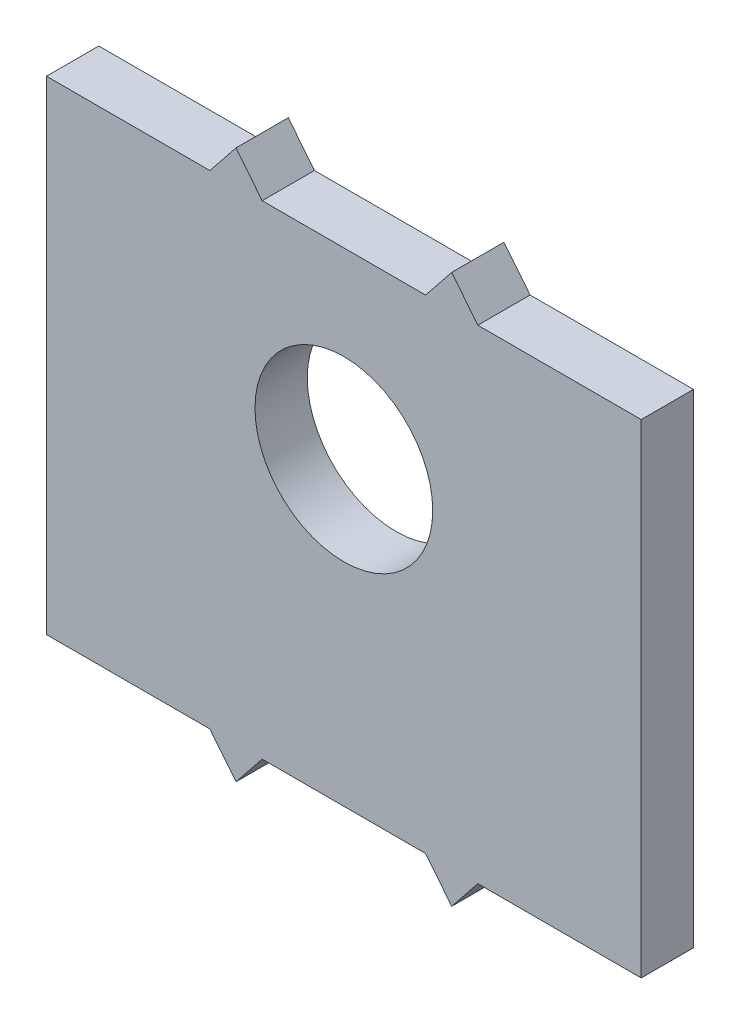
ISO-10303-21;
HEADER;
FILE_DESCRIPTION(('STEP AP214'),'2;1');
FILE_NAME('part.step','',(''),(''),'','','');
FILE_SCHEMA(('AUTOMOTIVE_DESIGN { 1 0 10303 214 1 1 1 1 }'));
ENDSEC;
DATA;
#1=APPLICATION_CONTEXT('core data for automotive mechanical design processes');
#2=APPLICATION_PROTOCOL_DEFINITION('international standard','automotive_design',2000,#1);
#3=PRODUCT_CONTEXT('',#1,'mechanical');
#4=PRODUCT('Part','Part','',(#3));
#5=PRODUCT_RELATED_PRODUCT_CATEGORY('part','',(#4));
#6=PRODUCT_DEFINITION_FORMATION('','',#4);
#7=PRODUCT_DEFINITION_CONTEXT('part definition',#1,'design');
#8=PRODUCT_DEFINITION('design','',#6,#7);
#9=PRODUCT_DEFINITION_SHAPE('','',#8);
#10=(LENGTH_UNIT() NAMED_UNIT(*) SI_UNIT(.MILLI.,.METRE.));
#11=(NAMED_UNIT(*) PLANE_ANGLE_UNIT() SI_UNIT($,.RADIAN.));
#12=(NAMED_UNIT(*) SI_UNIT($,.STERADIAN.) SOLID_ANGLE_UNIT());
#13=UNCERTAINTY_MEASURE_WITH_UNIT(LENGTH_MEASURE(1.E-05),#10,'distance_accuracy_value','');
#14=(GEOMETRIC_REPRESENTATION_CONTEXT(3) GLOBAL_UNCERTAINTY_ASSIGNED_CONTEXT((#13)) GLOBAL_UNIT_ASSIGNED_CONTEXT((#10,
#11,#12)) REPRESENTATION_CONTEXT('',''));
#15=CARTESIAN_POINT('',(0.,0.,0.));
#16=DIRECTION('',(0.,0.,1.));
#17=DIRECTION('',(1.,0.,0.));
#18=AXIS2_PLACEMENT_3D('',#15,#16,#17);
#19=CARTESIAN_POINT('',(0.,0.,4.));
#20=DIRECTION('',(0.,1.,0.));
#21=DIRECTION('',(0.,0.,1.));
#22=AXIS2_PLACEMENT_3D('',#19,#20,#21);
#23=PLANE('',#22);
#24=DIRECTION('',(1.,0.,0.));
#25=VECTOR('',#24,1.);
#26=CARTESIAN_POINT('',(0.,0.,0.));
#27=LINE('',#26,#25);
#28=CARTESIAN_POINT('',(0.,0.,0.));
#29=VERTEX_POINT('',#28);
#30=CARTESIAN_POINT('',(12.5,0.,0.));
#31=VERTEX_POINT('',#30);
#32=EDGE_CURVE('E215',#29,#31,#27,.T.);
#33=ORIENTED_EDGE('',*,*,#32,.T.);
#34=DIRECTION('',(0.,0.,-1.));
#35=VECTOR('',#34,1.);
#36=CARTESIAN_POINT('',(12.5,0.,4.));
#37=LINE('',#36,#35);
#38=CARTESIAN_POINT('',(12.5,0.,4.));
#39=VERTEX_POINT('',#38);
#40=EDGE_CURVE('E11',#39,#31,#37,.T.);
#41=ORIENTED_EDGE('',*,*,#40,.F.);
#42=DIRECTION('',(1.,0.,0.));
#43=VECTOR('',#42,1.);
#44=CARTESIAN_POINT('',(0.,0.,4.));
#45=LINE('',#44,#43);
#46=CARTESIAN_POINT('',(0.,0.,4.));
#47=VERTEX_POINT('',#46);
#48=EDGE_CURVE('E201',#47,#39,#45,.T.);
#49=ORIENTED_EDGE('',*,*,#48,.F.);
#50=DIRECTION('',(0.,0.,-1.));
#51=VECTOR('',#50,1.);
#52=CARTESIAN_POINT('',(0.,0.,4.));
#53=LINE('',#52,#51);
#54=EDGE_CURVE('E57',#47,#29,#53,.T.);
#55=ORIENTED_EDGE('',*,*,#54,.T.);
#56=EDGE_LOOP('',(#33,#41,#49,#55));
#57=FACE_BOUND('',#56,.T.);
#58=ADVANCED_FACE('F40',(#57),#23,.F.);
#59=CARTESIAN_POINT('',(7.6219512195122,6.09756097560976,4.));
#60=DIRECTION('',(0.78086880944303,0.624695047554424,0.));
#61=DIRECTION('',(-0.624695047554424,0.78086880944303,0.));
#62=AXIS2_PLACEMENT_3D('',#59,#60,#61);
#63=PLANE('',#62);
#64=DIRECTION('',(0.624695047554424,-0.78086880944303,0.));
#65=VECTOR('',#64,1.);
#66=CARTESIAN_POINT('',(7.6219512195122,6.09756097560976,0.));
#67=LINE('',#66,#65);
#68=CARTESIAN_POINT('',(14.5,-2.5,0.));
#69=VERTEX_POINT('',#68);
#70=EDGE_CURVE('E326',#31,#69,#67,.T.);
#71=ORIENTED_EDGE('',*,*,#70,.T.);
#72=DIRECTION('',(0.,0.,-1.));
#73=VECTOR('',#72,1.);
#74=CARTESIAN_POINT('',(14.5,-2.5,4.));
#75=LINE('',#74,#73);
#76=CARTESIAN_POINT('',(14.5,-2.5,4.));
#77=VERTEX_POINT('',#76);
#78=EDGE_CURVE('E49',#77,#69,#75,.T.);
#79=ORIENTED_EDGE('',*,*,#78,.F.);
#80=DIRECTION('',(0.624695047554424,-0.78086880944303,0.));
#81=VECTOR('',#80,1.);
#82=CARTESIAN_POINT('',(7.6219512195122,6.09756097560976,4.));
#83=LINE('',#82,#81);
#84=EDGE_CURVE('E119',#39,#77,#83,.T.);
#85=ORIENTED_EDGE('',*,*,#84,.F.);
#86=ORIENTED_EDGE('',*,*,#40,.T.);
#87=EDGE_LOOP('',(#71,#79,#85,#86));
#88=FACE_BOUND('',#87,.T.);
#89=ADVANCED_FACE('F42',(#88),#63,.F.);
#90=CARTESIAN_POINT('',(10.0609756097561,-8.04878048780488,4.));
#91=DIRECTION('',(-0.780868809443031,0.624695047554424,0.));
#92=DIRECTION('',(-0.624695047554424,-0.780868809443031,0.));
#93=AXIS2_PLACEMENT_3D('',#90,#91,#92);
#94=PLANE('',#93);
#95=DIRECTION('',(0.624695047554424,0.780868809443031,0.));
#96=VECTOR('',#95,1.);
#97=CARTESIAN_POINT('',(10.0609756097561,-8.04878048780488,0.));
#98=LINE('',#97,#96);
#99=CARTESIAN_POINT('',(16.5,0.,0.));
#100=VERTEX_POINT('',#99);
#101=EDGE_CURVE('E324',#69,#100,#98,.T.);
#102=ORIENTED_EDGE('',*,*,#101,.T.);
#103=DIRECTION('',(0.,0.,-1.));
#104=VECTOR('',#103,1.);
#105=CARTESIAN_POINT('',(16.5,0.,4.));
#106=LINE('',#105,#104);
#107=CARTESIAN_POINT('',(16.5,0.,4.));
#108=VERTEX_POINT('',#107);
#109=EDGE_CURVE('E317',#108,#100,#106,.T.);
#110=ORIENTED_EDGE('',*,*,#109,.F.);
#111=DIRECTION('',(0.624695047554424,0.780868809443031,0.));
#112=VECTOR('',#111,1.);
#113=CARTESIAN_POINT('',(10.0609756097561,-8.04878048780488,4.));
#114=LINE('',#113,#112);
#115=EDGE_CURVE('E208',#77,#108,#114,.T.);
#116=ORIENTED_EDGE('',*,*,#115,.F.);
#117=ORIENTED_EDGE('',*,*,#78,.T.);
#118=EDGE_LOOP('',(#102,#110,#116,#117));
#119=FACE_BOUND('',#118,.T.);
#120=ADVANCED_FACE('F242',(#119),#94,.F.);
#121=CARTESIAN_POINT('',(29.,0.,0.));
#122=VERTEX_POINT('',#121);
#123=EDGE_CURVE('E273',#100,#122,#27,.T.);
#124=ORIENTED_EDGE('',*,*,#123,.T.);
#125=DIRECTION('',(0.,0.,-1.));
#126=VECTOR('',#125,1.);
#127=CARTESIAN_POINT('',(29.,0.,4.));
#128=LINE('',#127,#126);
#129=CARTESIAN_POINT('',(29.,0.,4.));
#130=VERTEX_POINT('',#129);
#131=EDGE_CURVE('E315',#130,#122,#128,.T.);
#132=ORIENTED_EDGE('',*,*,#131,.F.);
#133=EDGE_CURVE('E200',#108,#130,#45,.T.);
#134=ORIENTED_EDGE('',*,*,#133,.F.);
#135=ORIENTED_EDGE('',*,*,#109,.T.);
#136=EDGE_LOOP('',(#124,#132,#134,#135));
#137=FACE_BOUND('',#136,.T.);
#138=ADVANCED_FACE('F237',(#137),#23,.F.);
#139=CARTESIAN_POINT('',(17.6829268292683,14.1463414634146,4.));
#140=DIRECTION('',(-0.78086880944303,-0.624695047554424,0.));
#141=DIRECTION('',(0.624695047554424,-0.78086880944303,0.));
#142=AXIS2_PLACEMENT_3D('',#139,#140,#141);
#143=PLANE('',#142);
#144=DIRECTION('',(-0.624695047554424,0.78086880944303,0.));
#145=VECTOR('',#144,1.);
#146=CARTESIAN_POINT('',(17.6829268292683,14.1463414634146,0.));
#147=LINE('',#146,#145);
#148=CARTESIAN_POINT('',(31.,-2.5,0.));
#149=VERTEX_POINT('',#148);
#150=EDGE_CURVE('E330',#149,#122,#147,.T.);
#151=ORIENTED_EDGE('',*,*,#150,.F.);
#152=DIRECTION('',(0.,0.,-1.));
#153=VECTOR('',#152,1.);
#154=CARTESIAN_POINT('',(31.,-2.5,4.));
#155=LINE('',#154,#153);
#156=CARTESIAN_POINT('',(31.,-2.5,4.));
#157=VERTEX_POINT('',#156);
#158=EDGE_CURVE('E313',#157,#149,#155,.T.);
#159=ORIENTED_EDGE('',*,*,#158,.F.);
#160=DIRECTION('',(-0.624695047554424,0.78086880944303,0.));
#161=VECTOR('',#160,1.);
#162=CARTESIAN_POINT('',(17.6829268292683,14.1463414634146,4.));
#163=LINE('',#162,#161);
#164=EDGE_CURVE('E205',#157,#130,#163,.T.);
#165=ORIENTED_EDGE('',*,*,#164,.T.);
#166=ORIENTED_EDGE('',*,*,#131,.T.);
#167=EDGE_LOOP('',(#151,#159,#165,#166));
#168=FACE_BOUND('',#167,.T.);
#169=ADVANCED_FACE('F246',(#168),#143,.T.);
#170=CARTESIAN_POINT('',(20.1219512195122,-16.0975609756098,4.));
#171=DIRECTION('',(0.78086880944303,-0.624695047554424,0.));
#172=DIRECTION('',(0.624695047554424,0.78086880944303,0.));
#173=AXIS2_PLACEMENT_3D('',#170,#171,#172);
#174=PLANE('',#173);
#175=DIRECTION('',(-0.624695047554424,-0.78086880944303,0.));
#176=VECTOR('',#175,1.);
#177=CARTESIAN_POINT('',(20.1219512195122,-16.0975609756098,0.));
#178=LINE('',#177,#176);
#179=CARTESIAN_POINT('',(33.,0.,0.));
#180=VERTEX_POINT('',#179);
#181=EDGE_CURVE('E271',#180,#149,#178,.T.);
#182=ORIENTED_EDGE('',*,*,#181,.F.);
#183=DIRECTION('',(0.,0.,-1.));
#184=VECTOR('',#183,1.);
#185=CARTESIAN_POINT('',(33.,0.,4.));
#186=LINE('',#185,#184);
#187=CARTESIAN_POINT('',(33.,0.,4.));
#188=VERTEX_POINT('',#187);
#189=EDGE_CURVE('E265',#188,#180,#186,.T.);
#190=ORIENTED_EDGE('',*,*,#189,.F.);
#191=DIRECTION('',(-0.624695047554424,-0.78086880944303,0.));
#192=VECTOR('',#191,1.);
#193=CARTESIAN_POINT('',(20.1219512195122,-16.0975609756098,4.));
#194=LINE('',#193,#192);
#195=EDGE_CURVE('E198',#188,#157,#194,.T.);
#196=ORIENTED_EDGE('',*,*,#195,.T.);
#197=ORIENTED_EDGE('',*,*,#158,.T.);
#198=EDGE_LOOP('',(#182,#190,#196,#197));
#199=FACE_BOUND('',#198,.T.);
#200=ADVANCED_FACE('F250',(#199),#174,.T.);
#201=CARTESIAN_POINT('',(45.5,0.,0.));
#202=VERTEX_POINT('',#201);
#203=EDGE_CURVE('E261',#180,#202,#27,.T.);
#204=ORIENTED_EDGE('',*,*,#203,.T.);
#205=DIRECTION('',(0.,0.,-1.));
#206=VECTOR('',#205,1.);
#207=CARTESIAN_POINT('',(45.5,0.,4.));
#208=LINE('',#207,#206);
#209=CARTESIAN_POINT('',(45.5,0.,4.));
#210=VERTEX_POINT('',#209);
#211=EDGE_CURVE('E264',#210,#202,#208,.T.);
#212=ORIENTED_EDGE('',*,*,#211,.F.);
#213=EDGE_CURVE('E195',#188,#210,#45,.T.);
#214=ORIENTED_EDGE('',*,*,#213,.F.);
#215=ORIENTED_EDGE('',*,*,#189,.T.);
#216=EDGE_LOOP('',(#204,#212,#214,#215));
#217=FACE_BOUND('',#216,.T.);
#218=ADVANCED_FACE('F238',(#217),#23,.F.);
#219=CARTESIAN_POINT('',(45.5,0.,4.));
#220=DIRECTION('',(-1.,0.,0.));
#221=DIRECTION('',(0.,0.,1.));
#222=AXIS2_PLACEMENT_3D('',#219,#220,#221);
#223=PLANE('',#222);
#224=DIRECTION('',(0.,1.,0.));
#225=VECTOR('',#224,1.);
#226=CARTESIAN_POINT('',(45.5,0.,0.));
#227=LINE('',#226,#225);
#228=CARTESIAN_POINT('',(45.5,37.,0.));
#229=VERTEX_POINT('',#228);
#230=EDGE_CURVE('E270',#202,#229,#227,.T.);
#231=ORIENTED_EDGE('',*,*,#230,.T.);
#232=DIRECTION('',(0.,0.,-1.));
#233=VECTOR('',#232,1.);
#234=CARTESIAN_POINT('',(45.5,37.,4.));
#235=LINE('',#234,#233);
#236=CARTESIAN_POINT('',(45.5,37.,4.));
#237=VERTEX_POINT('',#236);
#238=EDGE_CURVE('E276',#237,#229,#235,.T.);
#239=ORIENTED_EDGE('',*,*,#238,.F.);
#240=DIRECTION('',(0.,1.,0.));
#241=VECTOR('',#240,1.);
#242=CARTESIAN_POINT('',(45.5,0.,4.));
#243=LINE('',#242,#241);
#244=EDGE_CURVE('E192',#210,#237,#243,.T.);
#245=ORIENTED_EDGE('',*,*,#244,.F.);
#246=ORIENTED_EDGE('',*,*,#211,.T.);
#247=EDGE_LOOP('',(#231,#239,#245,#246));
#248=FACE_BOUND('',#247,.T.);
#249=ADVANCED_FACE('F249',(#248),#223,.F.);
#250=CARTESIAN_POINT('',(0.,37.,4.));
#251=DIRECTION('',(0.,1.,0.));
#252=DIRECTION('',(-1.,0.,0.));
#253=AXIS2_PLACEMENT_3D('',#250,#251,#252);
#254=PLANE('',#253);
#255=DIRECTION('',(1.,0.,0.));
#256=VECTOR('',#255,1.);
#257=CARTESIAN_POINT('',(0.,37.,0.));
#258=LINE('',#257,#256);
#259=CARTESIAN_POINT('',(33.,37.,0.));
#260=VERTEX_POINT('',#259);
#261=EDGE_CURVE('E280',#260,#229,#258,.T.);
#262=ORIENTED_EDGE('',*,*,#261,.F.);
#263=DIRECTION('',(0.,0.,-1.));
#264=VECTOR('',#263,1.);
#265=CARTESIAN_POINT('',(33.,37.,4.));
#266=LINE('',#265,#264);
#267=CARTESIAN_POINT('',(33.,37.,4.));
#268=VERTEX_POINT('',#267);
#269=EDGE_CURVE('E309',#268,#260,#266,.T.);
#270=ORIENTED_EDGE('',*,*,#269,.F.);
#271=DIRECTION('',(1.,0.,0.));
#272=VECTOR('',#271,1.);
#273=CARTESIAN_POINT('',(0.,37.,4.));
#274=LINE('',#273,#272);
#275=EDGE_CURVE('E184',#268,#237,#274,.T.);
#276=ORIENTED_EDGE('',*,*,#275,.T.);
#277=ORIENTED_EDGE('',*,*,#238,.T.);
#278=EDGE_LOOP('',(#262,#270,#276,#277));
#279=FACE_BOUND('',#278,.T.);
#280=ADVANCED_FACE('F256',(#279),#254,.T.);
#281=CARTESIAN_POINT('',(38.1707317073171,30.5365853658537,4.));
#282=DIRECTION('',(-0.78086880944303,-0.624695047554424,0.));
#283=DIRECTION('',(0.624695047554424,-0.78086880944303,0.));
#284=AXIS2_PLACEMENT_3D('',#281,#282,#283);
#285=PLANE('',#284);
#286=DIRECTION('',(-0.624695047554424,0.78086880944303,0.));
#287=VECTOR('',#286,1.);
#288=CARTESIAN_POINT('',(38.1707317073171,30.5365853658537,0.));
#289=LINE('',#288,#287);
#290=CARTESIAN_POINT('',(31.,39.5,0.));
#291=VERTEX_POINT('',#290);
#292=EDGE_CURVE('E282',#260,#291,#289,.T.);
#293=ORIENTED_EDGE('',*,*,#292,.T.);
#294=DIRECTION('',(0.,0.,-1.));
#295=VECTOR('',#294,1.);
#296=CARTESIAN_POINT('',(31.,39.5,4.));
#297=LINE('',#296,#295);
#298=CARTESIAN_POINT('',(31.,39.5,4.));
#299=VERTEX_POINT('',#298);
#300=EDGE_CURVE('E306',#299,#291,#297,.T.);
#301=ORIENTED_EDGE('',*,*,#300,.F.);
#302=DIRECTION('',(-0.624695047554424,0.78086880944303,0.));
#303=VECTOR('',#302,1.);
#304=CARTESIAN_POINT('',(38.1707317073171,30.5365853658537,4.));
#305=LINE('',#304,#303);
#306=EDGE_CURVE('E191',#268,#299,#305,.T.);
#307=ORIENTED_EDGE('',*,*,#306,.F.);
#308=ORIENTED_EDGE('',*,*,#269,.T.);
#309=EDGE_LOOP('',(#293,#301,#307,#308));
#310=FACE_BOUND('',#309,.T.);
#311=ADVANCED_FACE('F356',(#310),#285,.F.);
#312=CARTESIAN_POINT('',(-0.365853658536584,0.292682926829267,4.));
#313=DIRECTION('',(0.78086880944303,-0.624695047554424,0.));
#314=DIRECTION('',(0.624695047554424,0.78086880944303,0.));
#315=AXIS2_PLACEMENT_3D('',#312,#313,#314);
#316=PLANE('',#315);
#317=DIRECTION('',(-0.624695047554424,-0.78086880944303,0.));
#318=VECTOR('',#317,1.);
#319=CARTESIAN_POINT('',(-0.365853658536584,0.292682926829267,0.));
#320=LINE('',#319,#318);
#321=CARTESIAN_POINT('',(29.,37.,0.));
#322=VERTEX_POINT('',#321);
#323=EDGE_CURVE('E290',#291,#322,#320,.T.);
#324=ORIENTED_EDGE('',*,*,#323,.T.);
#325=DIRECTION('',(0.,0.,-1.));
#326=VECTOR('',#325,1.);
#327=CARTESIAN_POINT('',(29.,37.,4.));
#328=LINE('',#327,#326);
#329=CARTESIAN_POINT('',(29.,37.,4.));
#330=VERTEX_POINT('',#329);
#331=EDGE_CURVE('E304',#330,#322,#328,.T.);
#332=ORIENTED_EDGE('',*,*,#331,.F.);
#333=DIRECTION('',(-0.624695047554424,-0.78086880944303,0.));
#334=VECTOR('',#333,1.);
#335=CARTESIAN_POINT('',(-0.365853658536584,0.292682926829267,4.));
#336=LINE('',#335,#334);
#337=EDGE_CURVE('E189',#299,#330,#336,.T.);
#338=ORIENTED_EDGE('',*,*,#337,.F.);
#339=ORIENTED_EDGE('',*,*,#300,.T.);
#340=EDGE_LOOP('',(#324,#332,#338,#339));
#341=FACE_BOUND('',#340,.T.);
#342=ADVANCED_FACE('F346',(#341),#316,.F.);
#343=CARTESIAN_POINT('',(16.5,37.,0.));
#344=VERTEX_POINT('',#343);
#345=EDGE_CURVE('E285',#344,#322,#258,.T.);
#346=ORIENTED_EDGE('',*,*,#345,.F.);
#347=DIRECTION('',(0.,0.,-1.));
#348=VECTOR('',#347,1.);
#349=CARTESIAN_POINT('',(16.5,37.,4.));
#350=LINE('',#349,#348);
#351=CARTESIAN_POINT('',(16.5,37.,4.));
#352=VERTEX_POINT('',#351);
#353=EDGE_CURVE('E302',#352,#344,#350,.T.);
#354=ORIENTED_EDGE('',*,*,#353,.F.);
#355=EDGE_CURVE('E183',#352,#330,#274,.T.);
#356=ORIENTED_EDGE('',*,*,#355,.T.);
#357=ORIENTED_EDGE('',*,*,#331,.T.);
#358=EDGE_LOOP('',(#346,#354,#356,#357));
#359=FACE_BOUND('',#358,.T.);
#360=ADVANCED_FACE('F351',(#359),#254,.T.);
#361=CARTESIAN_POINT('',(28.109756097561,22.4878048780488,4.));
#362=DIRECTION('',(0.78086880944303,0.624695047554424,0.));
#363=DIRECTION('',(-0.624695047554424,0.78086880944303,0.));
#364=AXIS2_PLACEMENT_3D('',#361,#362,#363);
#365=PLANE('',#364);
#366=DIRECTION('',(0.624695047554424,-0.78086880944303,0.));
#367=VECTOR('',#366,1.);
#368=CARTESIAN_POINT('',(28.109756097561,22.4878048780488,0.));
#369=LINE('',#368,#367);
#370=CARTESIAN_POINT('',(14.5,39.5,0.));
#371=VERTEX_POINT('',#370);
#372=EDGE_CURVE('E293',#371,#344,#369,.T.);
#373=ORIENTED_EDGE('',*,*,#372,.F.);
#374=DIRECTION('',(0.,0.,-1.));
#375=VECTOR('',#374,1.);
#376=CARTESIAN_POINT('',(14.5,39.5,4.));
#377=LINE('',#376,#375);
#378=CARTESIAN_POINT('',(14.5,39.5,4.));
#379=VERTEX_POINT('',#378);
#380=EDGE_CURVE('E168',#379,#371,#377,.T.);
#381=ORIENTED_EDGE('',*,*,#380,.F.);
#382=DIRECTION('',(0.624695047554424,-0.78086880944303,0.));
#383=VECTOR('',#382,1.);
#384=CARTESIAN_POINT('',(28.109756097561,22.4878048780488,4.));
#385=LINE('',#384,#383);
#386=EDGE_CURVE('E178',#379,#352,#385,.T.);
#387=ORIENTED_EDGE('',*,*,#386,.T.);
#388=ORIENTED_EDGE('',*,*,#353,.T.);
#389=EDGE_LOOP('',(#373,#381,#387,#388));
#390=FACE_BOUND('',#389,.T.);
#391=ADVANCED_FACE('F354',(#390),#365,.T.);
#392=CARTESIAN_POINT('',(-10.4268292682927,8.34146341463413,4.));
#393=DIRECTION('',(-0.780868809443031,0.624695047554424,0.));
#394=DIRECTION('',(-0.624695047554424,-0.780868809443031,0.));
#395=AXIS2_PLACEMENT_3D('',#392,#393,#394);
#396=PLANE('',#395);
#397=DIRECTION('',(0.624695047554424,0.780868809443031,0.));
#398=VECTOR('',#397,1.);
#399=CARTESIAN_POINT('',(-10.4268292682927,8.34146341463413,0.));
#400=LINE('',#399,#398);
#401=CARTESIAN_POINT('',(12.5,37.,0.));
#402=VERTEX_POINT('',#401);
#403=EDGE_CURVE('E164',#402,#371,#400,.T.);
#404=ORIENTED_EDGE('',*,*,#403,.F.);
#405=DIRECTION('',(0.,0.,-1.));
#406=VECTOR('',#405,1.);
#407=CARTESIAN_POINT('',(12.5,37.,4.));
#408=LINE('',#407,#406);
#409=CARTESIAN_POINT('',(12.5,37.,4.));
#410=VERTEX_POINT('',#409);
#411=EDGE_CURVE('E159',#410,#402,#408,.T.);
#412=ORIENTED_EDGE('',*,*,#411,.F.);
#413=DIRECTION('',(0.624695047554424,0.780868809443031,0.));
#414=VECTOR('',#413,1.);
#415=CARTESIAN_POINT('',(-10.4268292682927,8.34146341463413,4.));
#416=LINE('',#415,#414);
#417=EDGE_CURVE('E162',#410,#379,#416,.T.);
#418=ORIENTED_EDGE('',*,*,#417,.T.);
#419=ORIENTED_EDGE('',*,*,#380,.T.);
#420=EDGE_LOOP('',(#404,#412,#418,#419));
#421=FACE_BOUND('',#420,.T.);
#422=ADVANCED_FACE('F161',(#421),#396,.T.);
#423=CARTESIAN_POINT('',(0.,37.,0.));
#424=VERTEX_POINT('',#423);
#425=EDGE_CURVE('E284',#424,#402,#258,.T.);
#426=ORIENTED_EDGE('',*,*,#425,.F.);
#427=DIRECTION('',(0.,0.,-1.));
#428=VECTOR('',#427,1.);
#429=CARTESIAN_POINT('',(0.,37.,4.));
#430=LINE('',#429,#428);
#431=CARTESIAN_POINT('',(0.,37.,4.));
#432=VERTEX_POINT('',#431);
#433=EDGE_CURVE('E107',#432,#424,#430,.T.);
#434=ORIENTED_EDGE('',*,*,#433,.F.);
#435=EDGE_CURVE('E175',#432,#410,#274,.T.);
#436=ORIENTED_EDGE('',*,*,#435,.T.);
#437=ORIENTED_EDGE('',*,*,#411,.T.);
#438=EDGE_LOOP('',(#426,#434,#436,#437));
#439=FACE_BOUND('',#438,.T.);
#440=ADVANCED_FACE('F180',(#439),#254,.T.);
#441=CARTESIAN_POINT('',(0.,0.,4.));
#442=DIRECTION('',(-1.,0.,0.));
#443=DIRECTION('',(0.,0.,1.));
#444=AXIS2_PLACEMENT_3D('',#441,#442,#443);
#445=PLANE('',#444);
#446=DIRECTION('',(0.,1.,0.));
#447=VECTOR('',#446,1.);
#448=CARTESIAN_POINT('',(0.,0.,0.));
#449=LINE('',#448,#447);
#450=EDGE_CURVE('E211',#29,#424,#449,.T.);
#451=ORIENTED_EDGE('',*,*,#450,.F.);
#452=ORIENTED_EDGE('',*,*,#54,.F.);
#453=DIRECTION('',(0.,1.,0.));
#454=VECTOR('',#453,1.);
#455=CARTESIAN_POINT('',(0.,0.,4.));
#456=LINE('',#455,#454);
#457=EDGE_CURVE('E181',#47,#432,#456,.T.);
#458=ORIENTED_EDGE('',*,*,#457,.T.);
#459=ORIENTED_EDGE('',*,*,#433,.T.);
#460=EDGE_LOOP('',(#451,#452,#458,#459));
#461=FACE_BOUND('',#460,.T.);
#462=ADVANCED_FACE('F224',(#461),#445,.T.);
#463=CARTESIAN_POINT('',(0.,0.,4.));
#464=DIRECTION('',(0.,0.,1.));
#465=DIRECTION('',(1.,0.,0.));
#466=AXIS2_PLACEMENT_3D('',#463,#464,#465);
#467=PLANE('',#466);
#468=CARTESIAN_POINT('',(22.75,23.,4.));
#469=DIRECTION('',(0.,0.,1.));
#470=DIRECTION('',(1.,0.,0.));
#471=AXIS2_PLACEMENT_3D('',#468,#469,#470);
#472=CIRCLE('',#471,6.8);
#473=CARTESIAN_POINT('',(29.55,23.,4.));
#474=VERTEX_POINT('',#473);
#475=EDGE_CURVE('E216',#474,#474,#472,.T.);
#476=ORIENTED_EDGE('',*,*,#475,.F.);
#477=EDGE_LOOP('',(#476));
#478=FACE_BOUND('',#477,.T.);
#479=ORIENTED_EDGE('',*,*,#48,.T.);
#480=ORIENTED_EDGE('',*,*,#84,.T.);
#481=ORIENTED_EDGE('',*,*,#115,.T.);
#482=ORIENTED_EDGE('',*,*,#133,.T.);
#483=ORIENTED_EDGE('',*,*,#164,.F.);
#484=ORIENTED_EDGE('',*,*,#195,.F.);
#485=ORIENTED_EDGE('',*,*,#213,.T.);
#486=ORIENTED_EDGE('',*,*,#244,.T.);
#487=ORIENTED_EDGE('',*,*,#275,.F.);
#488=ORIENTED_EDGE('',*,*,#306,.T.);
#489=ORIENTED_EDGE('',*,*,#337,.T.);
#490=ORIENTED_EDGE('',*,*,#355,.F.);
#491=ORIENTED_EDGE('',*,*,#386,.F.);
#492=ORIENTED_EDGE('',*,*,#417,.F.);
#493=ORIENTED_EDGE('',*,*,#435,.F.);
#494=ORIENTED_EDGE('',*,*,#457,.F.);
#495=EDGE_LOOP('',(#479,#480,#481,#482,#483,#484,#485,#486,#487,#488,#489,#490,#491,#492,#493,#494));
#496=FACE_BOUND('',#495,.T.);
#497=ADVANCED_FACE('F173',(#478,#496),#467,.T.);
#498=CARTESIAN_POINT('',(0.,0.,0.));
#499=DIRECTION('',(0.,0.,1.));
#500=DIRECTION('',(1.,0.,0.));
#501=AXIS2_PLACEMENT_3D('',#498,#499,#500);
#502=PLANE('',#501);
#503=CARTESIAN_POINT('',(22.75,23.,0.));
#504=DIRECTION('',(0.,0.,1.));
#505=DIRECTION('',(1.,0.,0.));
#506=AXIS2_PLACEMENT_3D('',#503,#504,#505);
#507=CIRCLE('',#506,6.8);
#508=CARTESIAN_POINT('',(29.55,23.,0.));
#509=VERTEX_POINT('',#508);
#510=EDGE_CURVE('E212',#509,#509,#507,.F.);
#511=ORIENTED_EDGE('',*,*,#510,.F.);
#512=EDGE_LOOP('',(#511));
#513=FACE_BOUND('',#512,.T.);
#514=ORIENTED_EDGE('',*,*,#32,.F.);
#515=ORIENTED_EDGE('',*,*,#450,.T.);
#516=ORIENTED_EDGE('',*,*,#425,.T.);
#517=ORIENTED_EDGE('',*,*,#403,.T.);
#518=ORIENTED_EDGE('',*,*,#372,.T.);
#519=ORIENTED_EDGE('',*,*,#345,.T.);
#520=ORIENTED_EDGE('',*,*,#323,.F.);
#521=ORIENTED_EDGE('',*,*,#292,.F.);
#522=ORIENTED_EDGE('',*,*,#261,.T.);
#523=ORIENTED_EDGE('',*,*,#230,.F.);
#524=ORIENTED_EDGE('',*,*,#203,.F.);
#525=ORIENTED_EDGE('',*,*,#181,.T.);
#526=ORIENTED_EDGE('',*,*,#150,.T.);
#527=ORIENTED_EDGE('',*,*,#123,.F.);
#528=ORIENTED_EDGE('',*,*,#101,.F.);
#529=ORIENTED_EDGE('',*,*,#70,.F.);
#530=EDGE_LOOP('',(#514,#515,#516,#517,#518,#519,#520,#521,#522,#523,#524,#525,#526,#527,#528,#529));
#531=FACE_BOUND('',#530,.T.);
#532=ADVANCED_FACE('F223',(#513,#531),#502,.F.);
#533=CARTESIAN_POINT('',(22.75,23.,-19.2333044482741));
#534=DIRECTION('',(0.,0.,1.));
#535=DIRECTION('',(1.,0.,0.));
#536=AXIS2_PLACEMENT_3D('',#533,#534,#535);
#537=CYLINDRICAL_SURFACE('',#536,6.8);
#538=ORIENTED_EDGE('',*,*,#510,.T.);
#539=EDGE_LOOP('',(#538));
#540=FACE_BOUND('',#539,.T.);
#541=ORIENTED_EDGE('',*,*,#475,.T.);
#542=EDGE_LOOP('',(#541));
#543=FACE_BOUND('',#542,.T.);
#544=ADVANCED_FACE('F220',(#540,#543),#537,.F.);
#545=CLOSED_SHELL('',(#58,#89,#120,#138,#169,#200,#218,#249,#280,#311,#342,#360,#391,#422,#440,
#462,#497,#532,#544));
#546=MANIFOLD_SOLID_BREP('B2',#545);
#547=ADVANCED_BREP_SHAPE_REPRESENTATION('',(#18,#546),#14);
#548=SHAPE_DEFINITION_REPRESENTATION(#9,#547);
ENDSEC;
END-ISO-10303-21;
